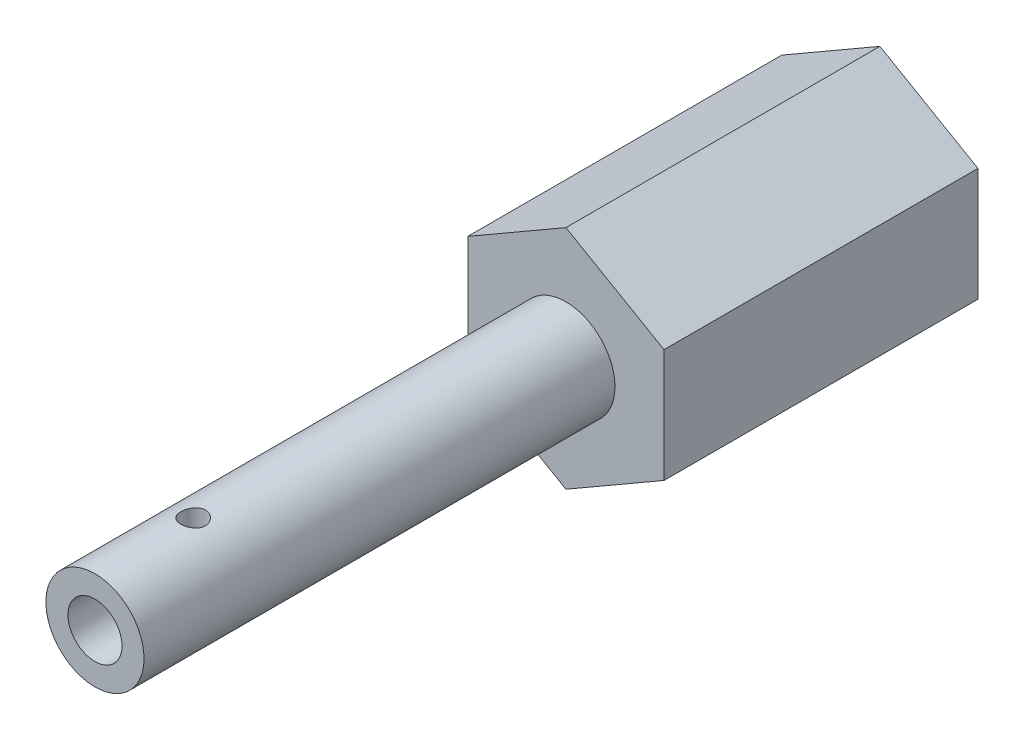
ISO-10303-21;
HEADER;
FILE_DESCRIPTION(('STEP AP214'),'2;1');
FILE_NAME('part.step','',(''),(''),'','','');
FILE_SCHEMA(('AUTOMOTIVE_DESIGN { 1 0 10303 214 1 1 1 1 }'));
ENDSEC;
DATA;
#1=APPLICATION_CONTEXT('core data for automotive mechanical design processes');
#2=APPLICATION_PROTOCOL_DEFINITION('international standard','automotive_design',2000,#1);
#3=PRODUCT_CONTEXT('',#1,'mechanical');
#4=PRODUCT('Part','Part','',(#3));
#5=PRODUCT_RELATED_PRODUCT_CATEGORY('part','',(#4));
#6=PRODUCT_DEFINITION_FORMATION('','',#4);
#7=PRODUCT_DEFINITION_CONTEXT('part definition',#1,'design');
#8=PRODUCT_DEFINITION('design','',#6,#7);
#9=PRODUCT_DEFINITION_SHAPE('','',#8);
#10=(LENGTH_UNIT() NAMED_UNIT(*) SI_UNIT(.MILLI.,.METRE.));
#11=(NAMED_UNIT(*) PLANE_ANGLE_UNIT() SI_UNIT($,.RADIAN.));
#12=(NAMED_UNIT(*) SI_UNIT($,.STERADIAN.) SOLID_ANGLE_UNIT());
#13=UNCERTAINTY_MEASURE_WITH_UNIT(LENGTH_MEASURE(1.E-05),#10,'distance_accuracy_value','');
#14=(GEOMETRIC_REPRESENTATION_CONTEXT(3) GLOBAL_UNCERTAINTY_ASSIGNED_CONTEXT((#13)) GLOBAL_UNIT_ASSIGNED_CONTEXT((#10,
#11,#12)) REPRESENTATION_CONTEXT('',''));
#15=CARTESIAN_POINT('',(0.,0.,0.));
#16=DIRECTION('',(0.,0.,1.));
#17=DIRECTION('',(1.,0.,0.));
#18=AXIS2_PLACEMENT_3D('',#15,#16,#17);
#19=CARTESIAN_POINT('',(6.35000000000004,-3.66617420935407,20.32));
#20=DIRECTION('',(-1.,0.,0.));
#21=DIRECTION('',(0.,-1.,0.));
#22=AXIS2_PLACEMENT_3D('',#19,#20,#21);
#23=PLANE('',#22);
#24=DIRECTION('',(0.,1.,0.));
#25=VECTOR('',#24,1.);
#26=CARTESIAN_POINT('',(6.35000000000004,-3.66617420935407,0.));
#27=LINE('',#26,#25);
#28=CARTESIAN_POINT('',(6.35000000000004,-3.66617420935407,0.));
#29=VERTEX_POINT('',#28);
#30=CARTESIAN_POINT('',(6.34999999999996,3.6661742093542,0.));
#31=VERTEX_POINT('',#30);
#32=EDGE_CURVE('E135',#29,#31,#27,.T.);
#33=ORIENTED_EDGE('',*,*,#32,.T.);
#34=DIRECTION('',(0.,0.,-1.));
#35=VECTOR('',#34,1.);
#36=CARTESIAN_POINT('',(6.34999999999996,3.6661742093542,20.32));
#37=LINE('',#36,#35);
#38=CARTESIAN_POINT('',(6.34999999999996,3.6661742093542,20.32));
#39=VERTEX_POINT('',#38);
#40=EDGE_CURVE('E55',#39,#31,#37,.T.);
#41=ORIENTED_EDGE('',*,*,#40,.F.);
#42=DIRECTION('',(0.,1.,0.));
#43=VECTOR('',#42,1.);
#44=CARTESIAN_POINT('',(6.35000000000004,-3.66617420935407,20.32));
#45=LINE('',#44,#43);
#46=CARTESIAN_POINT('',(6.35000000000004,-3.66617420935407,20.32));
#47=VERTEX_POINT('',#46);
#48=EDGE_CURVE('E146',#47,#39,#45,.T.);
#49=ORIENTED_EDGE('',*,*,#48,.F.);
#50=DIRECTION('',(0.,0.,-1.));
#51=VECTOR('',#50,1.);
#52=CARTESIAN_POINT('',(6.35000000000004,-3.66617420935407,20.32));
#53=LINE('',#52,#51);
#54=EDGE_CURVE('E131',#47,#29,#53,.T.);
#55=ORIENTED_EDGE('',*,*,#54,.T.);
#56=EDGE_LOOP('',(#33,#41,#49,#55));
#57=FACE_BOUND('',#56,.T.);
#58=ADVANCED_FACE('F41',(#57),#23,.F.);
#59=CARTESIAN_POINT('',(6.34999999999996,3.6661742093542,20.32));
#60=DIRECTION('',(-0.499999999999995,-0.866025403784442,0.));
#61=DIRECTION('',(0.866025403784442,-0.499999999999995,0.));
#62=AXIS2_PLACEMENT_3D('',#59,#60,#61);
#63=PLANE('',#62);
#64=DIRECTION('',(-0.866025403784441,0.499999999999995,0.));
#65=VECTOR('',#64,1.);
#66=CARTESIAN_POINT('',(6.34999999999996,3.6661742093542,0.));
#67=LINE('',#66,#65);
#68=CARTESIAN_POINT('',(0.,7.33234841870825,0.));
#69=VERTEX_POINT('',#68);
#70=EDGE_CURVE('E138',#31,#69,#67,.T.);
#71=ORIENTED_EDGE('',*,*,#70,.T.);
#72=DIRECTION('',(0.,0.,-1.));
#73=VECTOR('',#72,1.);
#74=CARTESIAN_POINT('',(0.,7.33234841870825,20.32));
#75=LINE('',#74,#73);
#76=CARTESIAN_POINT('',(0.,7.33234841870825,20.32));
#77=VERTEX_POINT('',#76);
#78=EDGE_CURVE('E150',#77,#69,#75,.T.);
#79=ORIENTED_EDGE('',*,*,#78,.F.);
#80=DIRECTION('',(-0.866025403784441,0.499999999999995,0.));
#81=VECTOR('',#80,1.);
#82=CARTESIAN_POINT('',(6.34999999999996,3.6661742093542,20.32));
#83=LINE('',#82,#81);
#84=EDGE_CURVE('E103',#39,#77,#83,.T.);
#85=ORIENTED_EDGE('',*,*,#84,.F.);
#86=ORIENTED_EDGE('',*,*,#40,.T.);
#87=EDGE_LOOP('',(#71,#79,#85,#86));
#88=FACE_BOUND('',#87,.T.);
#89=ADVANCED_FACE('F206',(#88),#63,.F.);
#90=CARTESIAN_POINT('',(0.,7.33234841870825,20.32));
#91=DIRECTION('',(0.500000000000001,-0.866025403784438,0.));
#92=DIRECTION('',(0.866025403784438,0.500000000000001,0.));
#93=AXIS2_PLACEMENT_3D('',#90,#91,#92);
#94=PLANE('',#93);
#95=DIRECTION('',(-0.866025403784438,-0.500000000000001,0.));
#96=VECTOR('',#95,1.);
#97=CARTESIAN_POINT('',(0.,7.33234841870825,0.));
#98=LINE('',#97,#96);
#99=CARTESIAN_POINT('',(-6.35000000000001,3.66617420935411,0.));
#100=VERTEX_POINT('',#99);
#101=EDGE_CURVE('E141',#69,#100,#98,.T.);
#102=ORIENTED_EDGE('',*,*,#101,.T.);
#103=DIRECTION('',(0.,0.,-1.));
#104=VECTOR('',#103,1.);
#105=CARTESIAN_POINT('',(-6.35000000000001,3.66617420935411,20.32));
#106=LINE('',#105,#104);
#107=CARTESIAN_POINT('',(-6.35000000000001,3.66617420935411,20.32));
#108=VERTEX_POINT('',#107);
#109=EDGE_CURVE('E126',#108,#100,#106,.T.);
#110=ORIENTED_EDGE('',*,*,#109,.F.);
#111=DIRECTION('',(-0.866025403784438,-0.500000000000001,0.));
#112=VECTOR('',#111,1.);
#113=CARTESIAN_POINT('',(0.,7.33234841870825,20.32));
#114=LINE('',#113,#112);
#115=EDGE_CURVE('E117',#77,#108,#114,.T.);
#116=ORIENTED_EDGE('',*,*,#115,.F.);
#117=ORIENTED_EDGE('',*,*,#78,.T.);
#118=EDGE_LOOP('',(#102,#110,#116,#117));
#119=FACE_BOUND('',#118,.T.);
#120=ADVANCED_FACE('F204',(#119),#94,.F.);
#121=CARTESIAN_POINT('',(-6.35000000000001,3.66617420935411,20.32));
#122=DIRECTION('',(1.,0.,0.));
#123=DIRECTION('',(0.,1.,0.));
#124=AXIS2_PLACEMENT_3D('',#121,#122,#123);
#125=PLANE('',#124);
#126=DIRECTION('',(0.,-1.,0.));
#127=VECTOR('',#126,1.);
#128=CARTESIAN_POINT('',(-6.35000000000001,3.66617420935411,0.));
#129=LINE('',#128,#127);
#130=CARTESIAN_POINT('',(-6.34999999999999,-3.66617420935416,0.));
#131=VERTEX_POINT('',#130);
#132=EDGE_CURVE('E125',#100,#131,#129,.T.);
#133=ORIENTED_EDGE('',*,*,#132,.T.);
#134=DIRECTION('',(0.,0.,-1.));
#135=VECTOR('',#134,1.);
#136=CARTESIAN_POINT('',(-6.34999999999999,-3.66617420935416,20.32));
#137=LINE('',#136,#135);
#138=CARTESIAN_POINT('',(-6.34999999999999,-3.66617420935416,20.32));
#139=VERTEX_POINT('',#138);
#140=EDGE_CURVE('E122',#139,#131,#137,.T.);
#141=ORIENTED_EDGE('',*,*,#140,.F.);
#142=DIRECTION('',(0.,-1.,0.));
#143=VECTOR('',#142,1.);
#144=CARTESIAN_POINT('',(-6.35000000000001,3.66617420935411,20.32));
#145=LINE('',#144,#143);
#146=EDGE_CURVE('E111',#108,#139,#145,.T.);
#147=ORIENTED_EDGE('',*,*,#146,.F.);
#148=ORIENTED_EDGE('',*,*,#109,.T.);
#149=EDGE_LOOP('',(#133,#141,#147,#148));
#150=FACE_BOUND('',#149,.T.);
#151=ADVANCED_FACE('F123',(#150),#125,.F.);
#152=CARTESIAN_POINT('',(-6.34999999999999,-3.66617420935416,20.32));
#153=DIRECTION('',(0.499999999999995,0.866025403784441,0.));
#154=DIRECTION('',(-0.866025403784442,0.499999999999995,0.));
#155=AXIS2_PLACEMENT_3D('',#152,#153,#154);
#156=PLANE('',#155);
#157=DIRECTION('',(0.866025403784442,-0.499999999999995,0.));
#158=VECTOR('',#157,1.);
#159=CARTESIAN_POINT('',(-6.34999999999999,-3.66617420935416,0.));
#160=LINE('',#159,#158);
#161=CARTESIAN_POINT('',(0.,-7.33234841870825,0.));
#162=VERTEX_POINT('',#161);
#163=EDGE_CURVE('E88',#131,#162,#160,.T.);
#164=ORIENTED_EDGE('',*,*,#163,.T.);
#165=DIRECTION('',(0.,0.,-1.));
#166=VECTOR('',#165,1.);
#167=CARTESIAN_POINT('',(0.,-7.33234841870825,20.32));
#168=LINE('',#167,#166);
#169=CARTESIAN_POINT('',(0.,-7.33234841870825,20.32));
#170=VERTEX_POINT('',#169);
#171=EDGE_CURVE('E127',#170,#162,#168,.T.);
#172=ORIENTED_EDGE('',*,*,#171,.F.);
#173=DIRECTION('',(0.866025403784442,-0.499999999999995,0.));
#174=VECTOR('',#173,1.);
#175=CARTESIAN_POINT('',(-6.34999999999999,-3.66617420935416,20.32));
#176=LINE('',#175,#174);
#177=EDGE_CURVE('E115',#139,#170,#176,.T.);
#178=ORIENTED_EDGE('',*,*,#177,.F.);
#179=ORIENTED_EDGE('',*,*,#140,.T.);
#180=EDGE_LOOP('',(#164,#172,#178,#179));
#181=FACE_BOUND('',#180,.T.);
#182=ADVANCED_FACE('F129',(#181),#156,.F.);
#183=CARTESIAN_POINT('',(0.,-7.33234841870825,20.32));
#184=DIRECTION('',(-0.500000000000007,0.866025403784435,0.));
#185=DIRECTION('',(-0.866025403784435,-0.500000000000007,0.));
#186=AXIS2_PLACEMENT_3D('',#183,#184,#185);
#187=PLANE('',#186);
#188=DIRECTION('',(0.866025403784435,0.500000000000007,0.));
#189=VECTOR('',#188,1.);
#190=CARTESIAN_POINT('',(0.,-7.33234841870825,0.));
#191=LINE('',#190,#189);
#192=EDGE_CURVE('E94',#162,#29,#191,.T.);
#193=ORIENTED_EDGE('',*,*,#192,.T.);
#194=ORIENTED_EDGE('',*,*,#54,.F.);
#195=DIRECTION('',(0.866025403784435,0.500000000000007,0.));
#196=VECTOR('',#195,1.);
#197=CARTESIAN_POINT('',(0.,-7.33234841870825,20.32));
#198=LINE('',#197,#196);
#199=EDGE_CURVE('E64',#170,#47,#198,.T.);
#200=ORIENTED_EDGE('',*,*,#199,.F.);
#201=ORIENTED_EDGE('',*,*,#171,.T.);
#202=EDGE_LOOP('',(#193,#194,#200,#201));
#203=FACE_BOUND('',#202,.T.);
#204=ADVANCED_FACE('F193',(#203),#187,.F.);
#205=CARTESIAN_POINT('',(0.,0.,20.32));
#206=DIRECTION('',(0.,0.,1.));
#207=DIRECTION('',(1.,0.,0.));
#208=AXIS2_PLACEMENT_3D('',#205,#206,#207);
#209=PLANE('',#208);
#210=CARTESIAN_POINT('',(0.,0.,20.32));
#211=DIRECTION('',(0.,0.,1.));
#212=DIRECTION('',(1.,0.,0.));
#213=AXIS2_PLACEMENT_3D('',#210,#211,#212);
#214=CIRCLE('',#213,3.175);
#215=CARTESIAN_POINT('',(3.175,0.,20.32));
#216=VERTEX_POINT('',#215);
#217=EDGE_CURVE('E11',#216,#216,#214,.T.);
#218=ORIENTED_EDGE('',*,*,#217,.F.);
#219=EDGE_LOOP('',(#218));
#220=FACE_BOUND('',#219,.T.);
#221=ORIENTED_EDGE('',*,*,#48,.T.);
#222=ORIENTED_EDGE('',*,*,#84,.T.);
#223=ORIENTED_EDGE('',*,*,#115,.T.);
#224=ORIENTED_EDGE('',*,*,#146,.T.);
#225=ORIENTED_EDGE('',*,*,#177,.T.);
#226=ORIENTED_EDGE('',*,*,#199,.T.);
#227=EDGE_LOOP('',(#221,#222,#223,#224,#225,#226));
#228=FACE_BOUND('',#227,.T.);
#229=ADVANCED_FACE('F113',(#220,#228),#209,.T.);
#230=CARTESIAN_POINT('',(0.,0.,0.));
#231=DIRECTION('',(0.,0.,1.));
#232=DIRECTION('',(1.,0.,0.));
#233=AXIS2_PLACEMENT_3D('',#230,#231,#232);
#234=PLANE('',#233);
#235=ORIENTED_EDGE('',*,*,#32,.F.);
#236=ORIENTED_EDGE('',*,*,#192,.F.);
#237=ORIENTED_EDGE('',*,*,#163,.F.);
#238=ORIENTED_EDGE('',*,*,#132,.F.);
#239=ORIENTED_EDGE('',*,*,#101,.F.);
#240=ORIENTED_EDGE('',*,*,#70,.F.);
#241=EDGE_LOOP('',(#235,#236,#237,#238,#239,#240));
#242=FACE_BOUND('',#241,.T.);
#243=ADVANCED_FACE('F188',(#242),#234,.F.);
#244=CARTESIAN_POINT('',(0.,0.,50.8));
#245=DIRECTION('',(0.,0.,-1.));
#246=DIRECTION('',(-1.,0.,0.));
#247=AXIS2_PLACEMENT_3D('',#244,#245,#246);
#248=CYLINDRICAL_SURFACE('',#247,3.175);
#249=CARTESIAN_POINT('',(0.,-3.175,45.24375));
#250=CARTESIAN_POINT('',(0.0438552635877326,-3.17499925846824,45.2437487692969));
#251=CARTESIAN_POINT('',(0.0877242751854454,-3.17408230928092,45.2401032210489));
#252=CARTESIAN_POINT('',(0.174205012995239,-3.17051326901651,45.2256391907667));
#253=CARTESIAN_POINT('',(0.216816012302431,-3.167860194514,45.2148166432862));
#254=CARTESIAN_POINT('',(0.299519378196611,-3.16111268934038,45.1863675617096));
#255=CARTESIAN_POINT('',(0.339614702315039,-3.15701999003938,45.1687491981798));
#256=CARTESIAN_POINT('',(0.416280669799421,-3.14782911098185,45.1272373477679));
#257=CARTESIAN_POINT('',(0.452851194217882,-3.14273089731102,45.1033436492204));
#258=CARTESIAN_POINT('',(0.522182686530067,-3.13196506358995,45.0494395821413));
#259=CARTESIAN_POINT('',(0.55486071932398,-3.12628865866099,45.0193242915841));
#260=CARTESIAN_POINT('',(0.614758807311743,-3.11506457312193,44.954056541569));
#261=CARTESIAN_POINT('',(0.641978246218912,-3.10951690710918,44.9189035141075));
#262=CARTESIAN_POINT('',(0.690576545564482,-3.0990898547443,44.8439141925181));
#263=CARTESIAN_POINT('',(0.71186263092716,-3.09422162074029,44.8040160820295));
#264=CARTESIAN_POINT('',(0.74739336410798,-3.08583274338135,44.7210664654975));
#265=CARTESIAN_POINT('',(0.761639137669973,-3.08231188460184,44.6780154648651));
#266=CARTESIAN_POINT('',(0.782401934475596,-3.07710668929704,44.5908940655345));
#267=CARTESIAN_POINT('',(0.789068075326384,-3.07538697360746,44.546861367507));
#268=CARTESIAN_POINT('',(0.794946855973397,-3.07387287676221,44.4582716322301));
#269=CARTESIAN_POINT('',(0.794160708378672,-3.07407818237408,44.4137146814637));
#270=CARTESIAN_POINT('',(0.785276202621611,-3.07635912908627,44.3264841350685));
#271=CARTESIAN_POINT('',(0.77735553835081,-3.07838931671828,44.2837910669747));
#272=CARTESIAN_POINT('',(0.754710298902889,-3.08401883870473,44.2003597772261));
#273=CARTESIAN_POINT('',(0.739985239011731,-3.08761828484494,44.1596216950638));
#274=CARTESIAN_POINT('',(0.703997765408405,-3.09602247774299,44.0807802997333));
#275=CARTESIAN_POINT('',(0.682670861410742,-3.10083902452569,44.0427077340947));
#276=CARTESIAN_POINT('',(0.634130196057907,-3.11112805322879,43.970618016087));
#277=CARTESIAN_POINT('',(0.606915404578005,-3.11660064985464,43.9366015749811));
#278=CARTESIAN_POINT('',(0.546451062227141,-3.12777653452301,43.8725714200284));
#279=CARTESIAN_POINT('',(0.513051561612766,-3.1334819509876,43.8426994990092));
#280=CARTESIAN_POINT('',(0.441648806345708,-3.14433990118774,43.7889537591962));
#281=CARTESIAN_POINT('',(0.403645411120452,-3.14949241803232,43.7650801236189));
#282=CARTESIAN_POINT('',(0.323911324427233,-3.15868966566505,43.7239565647896));
#283=CARTESIAN_POINT('',(0.282168278906226,-3.16273053067588,43.7067296741154));
#284=CARTESIAN_POINT('',(0.196255220975605,-3.16922106074626,43.6795770923954));
#285=CARTESIAN_POINT('',(0.152085674550461,-3.17167103017036,43.6696500047287));
#286=CARTESIAN_POINT('',(0.0637857343313862,-3.17465868364436,43.6575953715585));
#287=CARTESIAN_POINT('',(0.0196832643270921,-3.17524369981464,43.6552747320352));
#288=CARTESIAN_POINT('',(-0.0682798962491321,-3.17457034214314,43.6579692635877));
#289=CARTESIAN_POINT('',(-0.112140608228598,-3.1733121342381,43.6629837743145));
#290=CARTESIAN_POINT('',(-0.197704217227559,-3.1691240334656,43.6800471056904));
#291=CARTESIAN_POINT('',(-0.23942945878763,-3.16621918923325,43.6919905852566));
#292=CARTESIAN_POINT('',(-0.320281983922784,-3.15906523927229,43.7224524986317));
#293=CARTESIAN_POINT('',(-0.359409004654765,-3.15481599779068,43.7409715964491));
#294=CARTESIAN_POINT('',(-0.434722658635788,-3.14533125444339,43.7844332848629));
#295=CARTESIAN_POINT('',(-0.470844796304788,-3.14007958981668,43.8094840261433));
#296=CARTESIAN_POINT('',(-0.538441166386211,-3.12919802778343,43.8651596600717));
#297=CARTESIAN_POINT('',(-0.569914594956542,-3.12356806520694,43.8957855147139));
#298=CARTESIAN_POINT('',(-0.628115842271811,-3.11239406391742,43.9626385376135));
#299=CARTESIAN_POINT('',(-0.654708213283317,-3.10685552632436,43.9989847428388));
#300=CARTESIAN_POINT('',(-0.701416109977545,-3.09664564807956,44.0757376857381));
#301=CARTESIAN_POINT('',(-0.721531923158567,-3.09197426893801,44.1161442430662));
#302=CARTESIAN_POINT('',(-0.754565960072408,-3.0840790846376,44.1996542781102));
#303=CARTESIAN_POINT('',(-0.767526826562767,-3.08084672591967,44.2427400366654));
#304=CARTESIAN_POINT('',(-0.785995411725533,-3.07618735414389,44.330572183383));
#305=CARTESIAN_POINT('',(-0.791504760374115,-3.074759946268,44.3753182061714));
#306=CARTESIAN_POINT('',(-0.794828754051731,-3.07390218553761,44.4638223751234));
#307=CARTESIAN_POINT('',(-0.792859887575305,-3.0744156440204,44.5075719760868));
#308=CARTESIAN_POINT('',(-0.781778809773884,-3.07725185183317,44.5940941410868));
#309=CARTESIAN_POINT('',(-0.772666742005072,-3.07957456480274,44.6368667247406));
#310=CARTESIAN_POINT('',(-0.747676156538469,-3.08573625444607,44.7199853095888));
#311=CARTESIAN_POINT('',(-0.731838243310024,-3.08956612229214,44.7603442406896));
#312=CARTESIAN_POINT('',(-0.693877683449343,-3.09831187404389,44.8378608483527));
#313=CARTESIAN_POINT('',(-0.671754165143083,-3.10322790855576,44.8750180799781));
#314=CARTESIAN_POINT('',(-0.62117168365381,-3.11375231464442,44.9461226578469));
#315=CARTESIAN_POINT('',(-0.592562507041062,-3.11937540140138,44.9799609846868));
#316=CARTESIAN_POINT('',(-0.530113542254564,-3.1305924775116,45.0424269778709));
#317=CARTESIAN_POINT('',(-0.496272513750683,-3.13618645963902,45.0710534051014));
#318=CARTESIAN_POINT('',(-0.423580764630113,-3.14683592780222,45.1227884841154));
#319=CARTESIAN_POINT('',(-0.384650415142416,-3.15187982656105,45.1457878164012));
#320=CARTESIAN_POINT('',(-0.303353289824289,-3.16073856132667,45.184878865806));
#321=CARTESIAN_POINT('',(-0.260989002318604,-3.16455427751551,45.2009755325098));
#322=CARTESIAN_POINT('',(-0.182250425674667,-3.16996264853432,45.2234150935494));
#323=CARTESIAN_POINT('',(-0.146251173772183,-3.17183867923715,45.2310241994491));
#324=CARTESIAN_POINT('',(-0.0735044628546151,-3.17435761935239,45.2411919784999));
#325=CARTESIAN_POINT('',(-0.0367570603242171,-3.17500062151098,45.2437510315074));
#326=CARTESIAN_POINT('',(0.,-3.175,45.24375));
#327=B_SPLINE_CURVE_WITH_KNOTS('',3,(#249,#250,#251,#252,#253,#254,#255,#256,#257,#258,#259,
#260,#261,#262,#263,#264,#265,#266,#267,#268,#269,#270,#271,#272,#273,#274,#275,#276,#277,#278,
#279,#280,#281,#282,#283,#284,#285,#286,#287,#288,#289,#290,#291,#292,#293,#294,#295,#296,#297,
#298,#299,#300,#301,#302,#303,#304,#305,#306,#307,#308,#309,#310,#311,#312,#313,#314,#315,#316,
#317,#318,#319,#320,#321,#322,#323,#324,#325,#326),.UNSPECIFIED.,.T.,.F.,(4,2,2,2,2,2,2,2,2,2,2,
2,2,2,2,2,2,2,2,2,2,2,2,2,2,2,2,2,2,2,2,2,2,2,2,2,2,2,4),(0.,0.131431089516374,
0.262936692483394,0.394284677459728,0.525637093339598,0.659418054188191,0.793214110694487,
0.928997843263213,1.06475985702123,1.19780206156781,1.33082261834634,1.46061904666212,
1.59042472250777,1.72154070999926,1.85267965567467,1.9875579426277,2.12244034891237,
2.25778604517321,2.39310583993571,2.5249627181899,2.65680772672157,2.78669895263675,
2.91660329874709,3.04881273419995,3.18104500425073,3.31652302787365,3.45199503671611,
3.5866506806659,3.72127686471062,3.85203583794262,3.98279218339231,4.11277011962703,
4.2427660897244,4.37615317516906,4.50957193170175,4.64540698160194,4.78114446688793,
4.89131103556882,5.00146931739437),.UNSPECIFIED.);
#328=CARTESIAN_POINT('',(0.,-3.175,45.24375));
#329=VERTEX_POINT('',#328);
#330=EDGE_CURVE('E177',#329,#329,#327,.T.);
#331=ORIENTED_EDGE('',*,*,#330,.T.);
#332=EDGE_LOOP('',(#331));
#333=FACE_BOUND('',#332,.T.);
#334=CARTESIAN_POINT('',(0.,3.175,45.24375));
#335=CARTESIAN_POINT('',(-0.0438552635877327,3.17499925846823,45.2437487692969));
#336=CARTESIAN_POINT('',(-0.0877242751854456,3.17408230928092,45.2401032210489));
#337=CARTESIAN_POINT('',(-0.17420501299524,3.17051326901651,45.2256391907667));
#338=CARTESIAN_POINT('',(-0.216816012302432,3.167860194514,45.2148166432862));
#339=CARTESIAN_POINT('',(-0.299519378196611,3.16111268934038,45.1863675617096));
#340=CARTESIAN_POINT('',(-0.339614702315039,3.15701999003938,45.1687491981798));
#341=CARTESIAN_POINT('',(-0.416280669799422,3.14782911098185,45.1272373477679));
#342=CARTESIAN_POINT('',(-0.452851194217882,3.14273089731102,45.1033436492204));
#343=CARTESIAN_POINT('',(-0.522182686530067,3.13196506358995,45.0494395821413));
#344=CARTESIAN_POINT('',(-0.55486071932398,3.12628865866099,45.0193242915841));
#345=CARTESIAN_POINT('',(-0.614758807311743,3.11506457312193,44.954056541569));
#346=CARTESIAN_POINT('',(-0.641978246218912,3.10951690710918,44.9189035141075));
#347=CARTESIAN_POINT('',(-0.690576545564482,3.0990898547443,44.8439141925181));
#348=CARTESIAN_POINT('',(-0.71186263092716,3.09422162074029,44.8040160820295));
#349=CARTESIAN_POINT('',(-0.747393364107979,3.08583274338135,44.7210664654975));
#350=CARTESIAN_POINT('',(-0.761639137669973,3.08231188460184,44.6780154648651));
#351=CARTESIAN_POINT('',(-0.782401934475596,3.07710668929704,44.5908940655345));
#352=CARTESIAN_POINT('',(-0.789068075326384,3.07538697360746,44.546861367507));
#353=CARTESIAN_POINT('',(-0.794946855973397,3.07387287676221,44.4582716322301));
#354=CARTESIAN_POINT('',(-0.794160708378672,3.07407818237408,44.4137146814637));
#355=CARTESIAN_POINT('',(-0.785276202621611,3.07635912908627,44.3264841350685));
#356=CARTESIAN_POINT('',(-0.77735553835081,3.07838931671828,44.2837910669747));
#357=CARTESIAN_POINT('',(-0.754710298902889,3.08401883870473,44.2003597772261));
#358=CARTESIAN_POINT('',(-0.739985239011731,3.08761828484494,44.1596216950638));
#359=CARTESIAN_POINT('',(-0.703997765408405,3.09602247774299,44.0807802997333));
#360=CARTESIAN_POINT('',(-0.682670861410742,3.10083902452569,44.0427077340947));
#361=CARTESIAN_POINT('',(-0.634130196057906,3.11112805322879,43.970618016087));
#362=CARTESIAN_POINT('',(-0.606915404578004,3.11660064985464,43.9366015749811));
#363=CARTESIAN_POINT('',(-0.54645106222714,3.12777653452301,43.8725714200284));
#364=CARTESIAN_POINT('',(-0.513051561612765,3.1334819509876,43.8426994990092));
#365=CARTESIAN_POINT('',(-0.441648806345706,3.14433990118774,43.7889537591962));
#366=CARTESIAN_POINT('',(-0.403645411120451,3.14949241803232,43.7650801236189));
#367=CARTESIAN_POINT('',(-0.323911324427232,3.15868966566505,43.7239565647896));
#368=CARTESIAN_POINT('',(-0.282168278906226,3.16273053067588,43.7067296741154));
#369=CARTESIAN_POINT('',(-0.196255220975605,3.16922106074626,43.6795770923954));
#370=CARTESIAN_POINT('',(-0.152085674550461,3.17167103017036,43.6696500047287));
#371=CARTESIAN_POINT('',(-0.0637857343313856,3.17465868364436,43.6575953715585));
#372=CARTESIAN_POINT('',(-0.0196832643270914,3.17524369981464,43.6552747320352));
#373=CARTESIAN_POINT('',(0.0682798962491328,3.17457034214314,43.6579692635877));
#374=CARTESIAN_POINT('',(0.112140608228599,3.1733121342381,43.6629837743145));
#375=CARTESIAN_POINT('',(0.197704217227561,3.1691240334656,43.6800471056904));
#376=CARTESIAN_POINT('',(0.239429458787635,3.16621918923325,43.6919905852566));
#377=CARTESIAN_POINT('',(0.320281983922788,3.15906523927229,43.7224524986317));
#378=CARTESIAN_POINT('',(0.359409004654768,3.15481599779068,43.7409715964491));
#379=CARTESIAN_POINT('',(0.434722658635792,3.14533125444339,43.7844332848629));
#380=CARTESIAN_POINT('',(0.470844796304792,3.14007958981668,43.8094840261433));
#381=CARTESIAN_POINT('',(0.538441166386215,3.12919802778343,43.8651596600717));
#382=CARTESIAN_POINT('',(0.569914594956546,3.12356806520694,43.8957855147139));
#383=CARTESIAN_POINT('',(0.628115842271814,3.11239406391742,43.9626385376135));
#384=CARTESIAN_POINT('',(0.654708213283319,3.10685552632436,43.9989847428388));
#385=CARTESIAN_POINT('',(0.701416109977545,3.09664564807956,44.0757376857381));
#386=CARTESIAN_POINT('',(0.721531923158567,3.09197426893801,44.1161442430662));
#387=CARTESIAN_POINT('',(0.754565960072408,3.0840790846376,44.1996542781102));
#388=CARTESIAN_POINT('',(0.767526826562767,3.08084672591967,44.2427400366654));
#389=CARTESIAN_POINT('',(0.785995411725533,3.07618735414389,44.330572183383));
#390=CARTESIAN_POINT('',(0.791504760374115,3.074759946268,44.3753182061714));
#391=CARTESIAN_POINT('',(0.794828754051731,3.07390218553761,44.4638223751234));
#392=CARTESIAN_POINT('',(0.792859887575305,3.0744156440204,44.5075719760868));
#393=CARTESIAN_POINT('',(0.781778809773884,3.07725185183317,44.5940941410868));
#394=CARTESIAN_POINT('',(0.772666742005072,3.07957456480274,44.6368667247406));
#395=CARTESIAN_POINT('',(0.747676156538469,3.08573625444607,44.7199853095888));
#396=CARTESIAN_POINT('',(0.731838243310024,3.08956612229214,44.7603442406896));
#397=CARTESIAN_POINT('',(0.693877683449343,3.09831187404389,44.8378608483527));
#398=CARTESIAN_POINT('',(0.671754165143083,3.10322790855576,44.8750180799781));
#399=CARTESIAN_POINT('',(0.62117168365381,3.11375231464442,44.9461226578469));
#400=CARTESIAN_POINT('',(0.592562507041062,3.11937540140138,44.9799609846868));
#401=CARTESIAN_POINT('',(0.530113542254564,3.1305924775116,45.0424269778709));
#402=CARTESIAN_POINT('',(0.496272513750683,3.13618645963902,45.0710534051014));
#403=CARTESIAN_POINT('',(0.423580764630113,3.14683592780222,45.1227884841154));
#404=CARTESIAN_POINT('',(0.384650415142415,3.15187982656105,45.1457878164012));
#405=CARTESIAN_POINT('',(0.303353289824289,3.16073856132667,45.184878865806));
#406=CARTESIAN_POINT('',(0.260989002318603,3.16455427751551,45.2009755325098));
#407=CARTESIAN_POINT('',(0.182250425674666,3.16996264853432,45.2234150935494));
#408=CARTESIAN_POINT('',(0.146251173772183,3.17183867923716,45.2310241994491));
#409=CARTESIAN_POINT('',(0.0735044628546148,3.17435761935239,45.2411919784999));
#410=CARTESIAN_POINT('',(0.0367570603242169,3.17500062151098,45.2437510315074));
#411=CARTESIAN_POINT('',(0.,3.175,45.24375));
#412=B_SPLINE_CURVE_WITH_KNOTS('',3,(#334,#335,#336,#337,#338,#339,#340,#341,#342,#343,#344,
#345,#346,#347,#348,#349,#350,#351,#352,#353,#354,#355,#356,#357,#358,#359,#360,#361,#362,#363,
#364,#365,#366,#367,#368,#369,#370,#371,#372,#373,#374,#375,#376,#377,#378,#379,#380,#381,#382,
#383,#384,#385,#386,#387,#388,#389,#390,#391,#392,#393,#394,#395,#396,#397,#398,#399,#400,#401,
#402,#403,#404,#405,#406,#407,#408,#409,#410,#411),.UNSPECIFIED.,.T.,.F.,(4,2,2,2,2,2,2,2,2,2,2,
2,2,2,2,2,2,2,2,2,2,2,2,2,2,2,2,2,2,2,2,2,2,2,2,2,2,2,4),(0.,0.131431089516375,
0.262936692483395,0.394284677459728,0.525637093339599,0.659418054188191,0.793214110694487,
0.928997843263213,1.06475985702123,1.19780206156781,1.33082261834634,1.46061904666212,
1.59042472250777,1.72154070999926,1.85267965567467,1.9875579426277,2.12244034891237,
2.25778604517321,2.39310583993571,2.5249627181899,2.65680772672157,2.78669895263676,
2.91660329874709,3.04881273419996,3.18104500425074,3.31652302787365,3.45199503671611,
3.5866506806659,3.72127686471062,3.85203583794262,3.98279218339232,4.11277011962703,
4.2427660897244,4.37615317516906,4.50957193170175,4.64540698160194,4.78114446688793,
4.89131103556882,5.00146931739437),.UNSPECIFIED.);
#413=CARTESIAN_POINT('',(0.,3.175,45.24375));
#414=VERTEX_POINT('',#413);
#415=EDGE_CURVE('E171',#414,#414,#412,.T.);
#416=ORIENTED_EDGE('',*,*,#415,.T.);
#417=EDGE_LOOP('',(#416));
#418=FACE_BOUND('',#417,.T.);
#419=CARTESIAN_POINT('',(0.,0.,50.8));
#420=DIRECTION('',(0.,0.,1.));
#421=DIRECTION('',(1.,0.,0.));
#422=AXIS2_PLACEMENT_3D('',#419,#420,#421);
#423=CIRCLE('',#422,3.175);
#424=CARTESIAN_POINT('',(3.175,0.,50.8));
#425=VERTEX_POINT('',#424);
#426=EDGE_CURVE('E139',#425,#425,#423,.T.);
#427=ORIENTED_EDGE('',*,*,#426,.F.);
#428=EDGE_LOOP('',(#427));
#429=FACE_BOUND('',#428,.T.);
#430=ORIENTED_EDGE('',*,*,#217,.T.);
#431=EDGE_LOOP('',(#430));
#432=FACE_BOUND('',#431,.T.);
#433=ADVANCED_FACE('F182',(#333,#418,#429,#432),#248,.T.);
#434=CARTESIAN_POINT('',(0.,0.,50.8));
#435=DIRECTION('',(0.,0.,1.));
#436=DIRECTION('',(1.,0.,0.));
#437=AXIS2_PLACEMENT_3D('',#434,#435,#436);
#438=PLANE('',#437);
#439=CARTESIAN_POINT('',(0.,0.,50.8));
#440=DIRECTION('',(0.,0.,1.));
#441=DIRECTION('',(1.,0.,0.));
#442=AXIS2_PLACEMENT_3D('',#439,#440,#441);
#443=CIRCLE('',#442,1.74999999999999);
#444=CARTESIAN_POINT('',(1.74999999999999,0.,50.8));
#445=VERTEX_POINT('',#444);
#446=EDGE_CURVE('E224',#445,#445,#443,.T.);
#447=ORIENTED_EDGE('',*,*,#446,.F.);
#448=EDGE_LOOP('',(#447));
#449=FACE_BOUND('',#448,.T.);
#450=ORIENTED_EDGE('',*,*,#426,.T.);
#451=EDGE_LOOP('',(#450));
#452=FACE_BOUND('',#451,.T.);
#453=ADVANCED_FACE('F187',(#449,#452),#438,.T.);
#454=CARTESIAN_POINT('',(0.,0.,25.4));
#455=DIRECTION('',(0.,0.,1.));
#456=DIRECTION('',(1.,0.,0.));
#457=AXIS2_PLACEMENT_3D('',#454,#455,#456);
#458=CONICAL_SURFACE('',#457,1.75,1.02974425867665);
#459=CARTESIAN_POINT('',(0.,0.,24.3484939167018));
#460=VERTEX_POINT('',#459);
#461=VERTEX_LOOP('',#460);
#462=FACE_BOUND('',#461,.T.);
#463=CARTESIAN_POINT('',(0.,0.,25.4));
#464=DIRECTION('',(0.,0.,1.));
#465=DIRECTION('',(1.,0.,0.));
#466=AXIS2_PLACEMENT_3D('',#463,#464,#465);
#467=CIRCLE('',#466,1.75);
#468=CARTESIAN_POINT('',(1.75,0.,25.4));
#469=VERTEX_POINT('',#468);
#470=EDGE_CURVE('E222',#469,#469,#467,.T.);
#471=ORIENTED_EDGE('',*,*,#470,.T.);
#472=EDGE_LOOP('',(#471));
#473=FACE_BOUND('',#472,.T.);
#474=ADVANCED_FACE('F239',(#462,#473),#458,.F.);
#475=CARTESIAN_POINT('',(0.,0.,50.8));
#476=DIRECTION('',(0.,0.,1.));
#477=DIRECTION('',(1.,0.,0.));
#478=AXIS2_PLACEMENT_3D('',#475,#476,#477);
#479=CYLINDRICAL_SURFACE('',#478,1.74999999999999);
#480=CARTESIAN_POINT('',(0.,-1.74999999999999,45.24375));
#481=CARTESIAN_POINT('',(-0.0421881518719496,-1.74999612992706,45.2437450112485));
#482=CARTESIAN_POINT('',(-0.0844240233419925,-1.74845757189418,45.240367400755));
#483=CARTESIAN_POINT('',(-0.167683820977793,-1.74245085953981,45.2269863935373));
#484=CARTESIAN_POINT('',(-0.208704692738083,-1.73797588495933,45.2169675710688));
#485=CARTESIAN_POINT('',(-0.288187973002066,-1.72657281587175,45.190763822399));
#486=CARTESIAN_POINT('',(-0.32665906735729,-1.71965361829561,45.1746012433512));
#487=CARTESIAN_POINT('',(-0.400299931554003,-1.70401847656604,45.1366701207975));
#488=CARTESIAN_POINT('',(-0.435470370126497,-1.69530289751808,45.1149027162205));
#489=CARTESIAN_POINT('',(-0.503587604898429,-1.67636929960287,45.0650703366536));
#490=CARTESIAN_POINT('',(-0.536321275309247,-1.66609648005544,45.0367351116636));
#491=CARTESIAN_POINT('',(-0.596761333343324,-1.64541734362848,44.9751462011578));
#492=CARTESIAN_POINT('',(-0.624464599180177,-1.63501094811324,44.9418894845196));
#493=CARTESIAN_POINT('',(-0.675731448524964,-1.61452640247469,44.8689635603518));
#494=CARTESIAN_POINT('',(-0.69894138408094,-1.60450658208024,44.8290275547658));
#495=CARTESIAN_POINT('',(-0.738220104710756,-1.58682023458879,44.7453040468456));
#496=CARTESIAN_POINT('',(-0.754293219939464,-1.57915228140873,44.701518899293));
#497=CARTESIAN_POINT('',(-0.777922640797904,-1.56764209486603,44.613784920514));
#498=CARTESIAN_POINT('',(-0.78589184861709,-1.56361569264893,44.5699725073592));
#499=CARTESIAN_POINT('',(-0.794368846960809,-1.55932781154676,44.4814619288859));
#500=CARTESIAN_POINT('',(-0.794881946382376,-1.55906365387164,44.4367644164853));
#501=CARTESIAN_POINT('',(-0.788739175224573,-1.56217727884383,44.352252284187));
#502=CARTESIAN_POINT('',(-0.782752890026485,-1.56521493335516,44.3123737371031));
#503=CARTESIAN_POINT('',(-0.764920072865138,-1.57400605342639,44.2342643375987));
#504=CARTESIAN_POINT('',(-0.753072150396756,-1.5797601633725,44.1960338784801));
#505=CARTESIAN_POINT('',(-0.72361807737243,-1.59346942488217,44.121262864136));
#506=CARTESIAN_POINT('',(-0.7058871251138,-1.60147164752787,44.0847804975518));
#507=CARTESIAN_POINT('',(-0.665260749483219,-1.61876957097723,44.0151509070969));
#508=CARTESIAN_POINT('',(-0.642363114458372,-1.62806582504988,43.9820051202969));
#509=CARTESIAN_POINT('',(-0.589321879094506,-1.6480537283171,43.9164336279189));
#510=CARTESIAN_POINT('',(-0.558677658510175,-1.65879103640574,43.884425519338));
#511=CARTESIAN_POINT('',(-0.492372690634496,-1.67966566746727,43.8258478675852));
#512=CARTESIAN_POINT('',(-0.456710307077036,-1.68980279320155,43.7992801053055));
#513=CARTESIAN_POINT('',(-0.379910856998406,-1.70873607217358,43.7515634193754));
#514=CARTESIAN_POINT('',(-0.33863533455561,-1.71747906814298,43.7306146235034));
#515=CARTESIAN_POINT('',(-0.25264751711605,-1.73221433803183,43.696109827298));
#516=CARTESIAN_POINT('',(-0.20793750127787,-1.73820841805579,43.6825489718044));
#517=CARTESIAN_POINT('',(-0.119812204176167,-1.74641364671073,43.6641488550472));
#518=CARTESIAN_POINT('',(-0.076536117212974,-1.74886645504382,43.6587510993669));
#519=CARTESIAN_POINT('',(0.0103706687020691,-1.75050807981352,43.6551283551944));
#520=CARTESIAN_POINT('',(0.0540012348054571,-1.74969806741355,43.6569007930195));
#521=CARTESIAN_POINT('',(0.137561014498961,-1.74505663397324,43.6671972623919));
#522=CARTESIAN_POINT('',(0.177553557545055,-1.74141273213713,43.6753024065977));
#523=CARTESIAN_POINT('',(0.255551863967046,-1.73168670413328,43.6974202957154));
#524=CARTESIAN_POINT('',(0.293557388848909,-1.72560428603595,43.7114337479572));
#525=CARTESIAN_POINT('',(0.36784634877902,-1.71133425034668,43.74540896746));
#526=CARTESIAN_POINT('',(0.404039690008149,-1.70308713812592,43.7655418967427));
#527=CARTESIAN_POINT('',(0.472664198090476,-1.68533289108932,43.8109980381134));
#528=CARTESIAN_POINT('',(0.505093706115093,-1.6758252046275,43.8363235252083));
#529=CARTESIAN_POINT('',(0.568130382727784,-1.65557046619108,43.8939081265342));
#530=CARTESIAN_POINT('',(0.598358719062771,-1.64478624418048,43.9265698321073));
#531=CARTESIAN_POINT('',(0.653039792801151,-1.62385288677709,43.9966200455488));
#532=CARTESIAN_POINT('',(0.677490203625061,-1.6137040084212,44.0340104482354));
#533=CARTESIAN_POINT('',(0.720497308165288,-1.59497662558113,44.1138003866114));
#534=CARTESIAN_POINT('',(0.738877116638301,-1.58644789932466,44.1563078824911));
#535=CARTESIAN_POINT('',(0.768037711148962,-1.57254049761336,44.2443285608834));
#536=CARTESIAN_POINT('',(0.778826332380145,-1.5671585751788,44.2898385911102));
#537=CARTESIAN_POINT('',(0.791656578518687,-1.56071352488667,44.3783078028995));
#538=CARTESIAN_POINT('',(0.794378100237146,-1.55931511840841,44.4211439993074));
#539=CARTESIAN_POINT('',(0.792878447688471,-1.56007851671157,44.5066571098877));
#540=CARTESIAN_POINT('',(0.788658928897811,-1.56223947256557,44.5493340596082));
#541=CARTESIAN_POINT('',(0.773999577820076,-1.569549016298,44.630419411353));
#542=CARTESIAN_POINT('',(0.763983166684698,-1.57449366319469,44.6689247167014));
#543=CARTESIAN_POINT('',(0.738472803180532,-1.58661785939495,44.7436982531377));
#544=CARTESIAN_POINT('',(0.722977249747258,-1.59379806187863,44.7799658266943));
#545=CARTESIAN_POINT('',(0.685797689269456,-1.61016114863854,44.8518237486138));
#546=CARTESIAN_POINT('',(0.663776522290096,-1.619443967979,44.8872163565733));
#547=CARTESIAN_POINT('',(0.614597815630445,-1.63873942951868,44.9540143820796));
#548=CARTESIAN_POINT('',(0.587438021507832,-1.6487523908597,44.9854180394302));
#549=CARTESIAN_POINT('',(0.525782223712339,-1.6694924294672,45.0463555756344));
#550=CARTESIAN_POINT('',(0.490839680440159,-1.6801997279623,45.07544671633));
#551=CARTESIAN_POINT('',(0.416203656992755,-1.70022515417021,45.1274073173605));
#552=CARTESIAN_POINT('',(0.376507991741253,-1.70954263851179,45.1502739002456));
#553=CARTESIAN_POINT('',(0.29373097975841,-1.72568368114505,45.1888008501359));
#554=CARTESIAN_POINT('',(0.250683577531181,-1.73252907631528,45.204524648119));
#555=CARTESIAN_POINT('',(0.162241467755762,-1.74302742466285,45.2283319073966));
#556=CARTESIAN_POINT('',(0.116854294086036,-1.74669001989539,45.2364384507054));
#557=CARTESIAN_POINT('',(0.0474686585451805,-1.74951831866649,45.2426875023215));
#558=CARTESIAN_POINT('',(0.0237418856945177,-1.7500021779297,45.2437528074794));
#559=CARTESIAN_POINT('',(0.,-1.74999999999999,45.24375));
#560=B_SPLINE_CURVE_WITH_KNOTS('',3,(#480,#481,#482,#483,#484,#485,#486,#487,#488,#489,#490,
#491,#492,#493,#494,#495,#496,#497,#498,#499,#500,#501,#502,#503,#504,#505,#506,#507,#508,#509,
#510,#511,#512,#513,#514,#515,#516,#517,#518,#519,#520,#521,#522,#523,#524,#525,#526,#527,#528,
#529,#530,#531,#532,#533,#534,#535,#536,#537,#538,#539,#540,#541,#542,#543,#544,#545,#546,#547,
#548,#549,#550,#551,#552,#553,#554,#555,#556,#557,#558,#559),.UNSPECIFIED.,.T.,.F.,(4,2,2,2,2,2,
2,2,2,2,2,2,2,2,2,2,2,2,2,2,2,2,2,2,2,2,2,2,2,2,2,2,2,2,2,2,2,2,2,4),(0.,0.126488414951208,
0.253271662706135,0.379598097794255,0.505898882945721,0.638818627361466,0.771820579753733,
0.912901011720769,1.0538957279691,1.18727956399194,1.3205684234213,1.44132368337061,
1.56210760278297,1.68563783025457,1.8092210367925,1.94539816226269,2.08161979417673,
2.22219132291049,2.36267035995011,2.49301748732607,2.62331783181308,2.7456615359839,
2.86801989103827,2.99417692472794,3.12038934996145,3.25715027896692,3.39396618359493,
3.53447480012668,3.67483817803933,3.80297835142832,3.93108796710964,4.05084636153776,
4.17063977961964,4.29823065542006,4.42587763883142,4.5653500108666,4.7048867482499,
4.84315887942561,4.98101065042212,5.05219351471462),.UNSPECIFIED.);
#561=CARTESIAN_POINT('',(0.,-1.74999999999999,45.24375));
#562=VERTEX_POINT('',#561);
#563=EDGE_CURVE('E44',#562,#562,#560,.T.);
#564=ORIENTED_EDGE('',*,*,#563,.T.);
#565=EDGE_LOOP('',(#564));
#566=FACE_BOUND('',#565,.T.);
#567=CARTESIAN_POINT('',(0.,1.74999999999999,45.24375));
#568=CARTESIAN_POINT('',(0.0421881518719496,1.74999612992706,45.2437450112485));
#569=CARTESIAN_POINT('',(0.0844240233419925,1.74845757189418,45.240367400755));
#570=CARTESIAN_POINT('',(0.167683820977793,1.74245085953981,45.2269863935373));
#571=CARTESIAN_POINT('',(0.208704692738083,1.73797588495933,45.2169675710688));
#572=CARTESIAN_POINT('',(0.288187973002066,1.72657281587175,45.190763822399));
#573=CARTESIAN_POINT('',(0.32665906735729,1.71965361829561,45.1746012433512));
#574=CARTESIAN_POINT('',(0.400299931554003,1.70401847656604,45.1366701207975));
#575=CARTESIAN_POINT('',(0.435470370126497,1.69530289751808,45.1149027162205));
#576=CARTESIAN_POINT('',(0.503587604898429,1.67636929960287,45.0650703366536));
#577=CARTESIAN_POINT('',(0.536321275309247,1.66609648005544,45.0367351116636));
#578=CARTESIAN_POINT('',(0.596761333343324,1.64541734362848,44.9751462011578));
#579=CARTESIAN_POINT('',(0.624464599180177,1.63501094811324,44.9418894845196));
#580=CARTESIAN_POINT('',(0.675731448524964,1.61452640247469,44.8689635603518));
#581=CARTESIAN_POINT('',(0.69894138408094,1.60450658208024,44.8290275547658));
#582=CARTESIAN_POINT('',(0.738220104710756,1.58682023458879,44.7453040468456));
#583=CARTESIAN_POINT('',(0.754293219939464,1.57915228140873,44.701518899293));
#584=CARTESIAN_POINT('',(0.777922640797904,1.56764209486603,44.613784920514));
#585=CARTESIAN_POINT('',(0.78589184861709,1.56361569264893,44.5699725073592));
#586=CARTESIAN_POINT('',(0.794368846960809,1.55932781154676,44.4814619288859));
#587=CARTESIAN_POINT('',(0.794881946382376,1.55906365387164,44.4367644164853));
#588=CARTESIAN_POINT('',(0.788739175224573,1.56217727884383,44.352252284187));
#589=CARTESIAN_POINT('',(0.782752890026485,1.56521493335516,44.3123737371031));
#590=CARTESIAN_POINT('',(0.764920072865138,1.57400605342639,44.2342643375987));
#591=CARTESIAN_POINT('',(0.753072150396756,1.5797601633725,44.1960338784801));
#592=CARTESIAN_POINT('',(0.72361807737243,1.59346942488217,44.121262864136));
#593=CARTESIAN_POINT('',(0.7058871251138,1.60147164752787,44.0847804975518));
#594=CARTESIAN_POINT('',(0.665260749483219,1.61876957097723,44.0151509070969));
#595=CARTESIAN_POINT('',(0.642363114458372,1.62806582504988,43.9820051202969));
#596=CARTESIAN_POINT('',(0.589321879094506,1.6480537283171,43.9164336279189));
#597=CARTESIAN_POINT('',(0.558677658510175,1.65879103640574,43.884425519338));
#598=CARTESIAN_POINT('',(0.492372690634496,1.67966566746727,43.8258478675852));
#599=CARTESIAN_POINT('',(0.456710307077036,1.68980279320155,43.7992801053055));
#600=CARTESIAN_POINT('',(0.379910856998406,1.70873607217358,43.7515634193754));
#601=CARTESIAN_POINT('',(0.33863533455561,1.71747906814298,43.7306146235034));
#602=CARTESIAN_POINT('',(0.25264751711605,1.73221433803183,43.696109827298));
#603=CARTESIAN_POINT('',(0.20793750127787,1.73820841805579,43.6825489718044));
#604=CARTESIAN_POINT('',(0.119812204176167,1.74641364671073,43.6641488550472));
#605=CARTESIAN_POINT('',(0.076536117212974,1.74886645504382,43.6587510993669));
#606=CARTESIAN_POINT('',(-0.0103706687020691,1.75050807981352,43.6551283551944));
#607=CARTESIAN_POINT('',(-0.0540012348054571,1.74969806741355,43.6569007930195));
#608=CARTESIAN_POINT('',(-0.137561014498961,1.74505663397324,43.6671972623919));
#609=CARTESIAN_POINT('',(-0.177553557545055,1.74141273213713,43.6753024065977));
#610=CARTESIAN_POINT('',(-0.255551863967046,1.73168670413328,43.6974202957154));
#611=CARTESIAN_POINT('',(-0.293557388848909,1.72560428603595,43.7114337479572));
#612=CARTESIAN_POINT('',(-0.36784634877902,1.71133425034668,43.74540896746));
#613=CARTESIAN_POINT('',(-0.404039690008149,1.70308713812592,43.7655418967427));
#614=CARTESIAN_POINT('',(-0.472664198090476,1.68533289108932,43.8109980381134));
#615=CARTESIAN_POINT('',(-0.505093706115093,1.6758252046275,43.8363235252083));
#616=CARTESIAN_POINT('',(-0.568130382727784,1.65557046619108,43.8939081265342));
#617=CARTESIAN_POINT('',(-0.598358719062771,1.64478624418048,43.9265698321073));
#618=CARTESIAN_POINT('',(-0.653039792801151,1.62385288677709,43.9966200455488));
#619=CARTESIAN_POINT('',(-0.677490203625061,1.6137040084212,44.0340104482354));
#620=CARTESIAN_POINT('',(-0.720497308165288,1.59497662558113,44.1138003866114));
#621=CARTESIAN_POINT('',(-0.738877116638301,1.58644789932466,44.1563078824911));
#622=CARTESIAN_POINT('',(-0.768037711148962,1.57254049761336,44.2443285608834));
#623=CARTESIAN_POINT('',(-0.778826332380145,1.5671585751788,44.2898385911102));
#624=CARTESIAN_POINT('',(-0.791656578518687,1.56071352488667,44.3783078028995));
#625=CARTESIAN_POINT('',(-0.794378100237146,1.55931511840841,44.4211439993074));
#626=CARTESIAN_POINT('',(-0.792878447688471,1.56007851671157,44.5066571098877));
#627=CARTESIAN_POINT('',(-0.788658928897811,1.56223947256557,44.5493340596082));
#628=CARTESIAN_POINT('',(-0.773999577820076,1.569549016298,44.630419411353));
#629=CARTESIAN_POINT('',(-0.763983166684698,1.57449366319469,44.6689247167014));
#630=CARTESIAN_POINT('',(-0.738472803180532,1.58661785939495,44.7436982531377));
#631=CARTESIAN_POINT('',(-0.722977249747258,1.59379806187863,44.7799658266943));
#632=CARTESIAN_POINT('',(-0.685797689269456,1.61016114863854,44.8518237486138));
#633=CARTESIAN_POINT('',(-0.663776522290096,1.619443967979,44.8872163565733));
#634=CARTESIAN_POINT('',(-0.614597815630445,1.63873942951868,44.9540143820796));
#635=CARTESIAN_POINT('',(-0.587438021507832,1.6487523908597,44.9854180394302));
#636=CARTESIAN_POINT('',(-0.525782223712339,1.6694924294672,45.0463555756344));
#637=CARTESIAN_POINT('',(-0.490839680440159,1.6801997279623,45.07544671633));
#638=CARTESIAN_POINT('',(-0.416203656992755,1.70022515417021,45.1274073173605));
#639=CARTESIAN_POINT('',(-0.376507991741253,1.70954263851179,45.1502739002456));
#640=CARTESIAN_POINT('',(-0.29373097975841,1.72568368114505,45.1888008501359));
#641=CARTESIAN_POINT('',(-0.250683577531181,1.73252907631528,45.204524648119));
#642=CARTESIAN_POINT('',(-0.162241467755762,1.74302742466285,45.2283319073966));
#643=CARTESIAN_POINT('',(-0.116854294086036,1.74669001989539,45.2364384507054));
#644=CARTESIAN_POINT('',(-0.0474686585451805,1.74951831866649,45.2426875023215));
#645=CARTESIAN_POINT('',(-0.0237418856945177,1.7500021779297,45.2437528074794));
#646=CARTESIAN_POINT('',(0.,1.74999999999999,45.24375));
#647=B_SPLINE_CURVE_WITH_KNOTS('',3,(#567,#568,#569,#570,#571,#572,#573,#574,#575,#576,#577,
#578,#579,#580,#581,#582,#583,#584,#585,#586,#587,#588,#589,#590,#591,#592,#593,#594,#595,#596,
#597,#598,#599,#600,#601,#602,#603,#604,#605,#606,#607,#608,#609,#610,#611,#612,#613,#614,#615,
#616,#617,#618,#619,#620,#621,#622,#623,#624,#625,#626,#627,#628,#629,#630,#631,#632,#633,#634,
#635,#636,#637,#638,#639,#640,#641,#642,#643,#644,#645,#646),.UNSPECIFIED.,.T.,.F.,(4,2,2,2,2,2,
2,2,2,2,2,2,2,2,2,2,2,2,2,2,2,2,2,2,2,2,2,2,2,2,2,2,2,2,2,2,2,2,2,4),(0.,0.126488414951208,
0.253271662706135,0.379598097794255,0.505898882945721,0.638818627361466,0.771820579753733,
0.912901011720769,1.0538957279691,1.18727956399194,1.3205684234213,1.44132368337061,
1.56210760278297,1.68563783025457,1.8092210367925,1.94539816226269,2.08161979417673,
2.22219132291049,2.36267035995011,2.49301748732607,2.62331783181308,2.7456615359839,
2.86801989103827,2.99417692472794,3.12038934996145,3.25715027896692,3.39396618359493,
3.53447480012668,3.67483817803933,3.80297835142832,3.93108796710964,4.05084636153776,
4.17063977961964,4.29823065542006,4.42587763883142,4.5653500108666,4.7048867482499,
4.84315887942561,4.98101065042212,5.05219351471462),.UNSPECIFIED.);
#648=CARTESIAN_POINT('',(0.,1.74999999999999,45.24375));
#649=VERTEX_POINT('',#648);
#650=EDGE_CURVE('E153',#649,#649,#647,.T.);
#651=ORIENTED_EDGE('',*,*,#650,.T.);
#652=EDGE_LOOP('',(#651));
#653=FACE_BOUND('',#652,.T.);
#654=ORIENTED_EDGE('',*,*,#470,.F.);
#655=EDGE_LOOP('',(#654));
#656=FACE_BOUND('',#655,.T.);
#657=ORIENTED_EDGE('',*,*,#446,.T.);
#658=EDGE_LOOP('',(#657));
#659=FACE_BOUND('',#658,.T.);
#660=ADVANCED_FACE('F158',(#566,#653,#656,#659),#479,.F.);
#661=CARTESIAN_POINT('',(0.,7.62,44.45));
#662=DIRECTION('',(0.,1.,0.));
#663=DIRECTION('',(0.,0.,1.));
#664=AXIS2_PLACEMENT_3D('',#661,#662,#663);
#665=CYLINDRICAL_SURFACE('',#664,0.793749999999992);
#666=ORIENTED_EDGE('',*,*,#650,.F.);
#667=EDGE_LOOP('',(#666));
#668=FACE_BOUND('',#667,.T.);
#669=ORIENTED_EDGE('',*,*,#415,.F.);
#670=EDGE_LOOP('',(#669));
#671=FACE_BOUND('',#670,.T.);
#672=ADVANCED_FACE('F164',(#668,#671),#665,.F.);
#673=ORIENTED_EDGE('',*,*,#563,.F.);
#674=EDGE_LOOP('',(#673));
#675=FACE_BOUND('',#674,.T.);
#676=ORIENTED_EDGE('',*,*,#330,.F.);
#677=EDGE_LOOP('',(#676));
#678=FACE_BOUND('',#677,.T.);
#679=ADVANCED_FACE('F161',(#675,#678),#665,.F.);
#680=CLOSED_SHELL('',(#58,#89,#120,#151,#182,#204,#229,#243,#433,#453,#474,#660,#672,#679));
#681=MANIFOLD_SOLID_BREP('B2',#680);
#682=ADVANCED_BREP_SHAPE_REPRESENTATION('',(#18,#681),#14);
#683=SHAPE_DEFINITION_REPRESENTATION(#9,#682);
ENDSEC;
END-ISO-10303-21;
